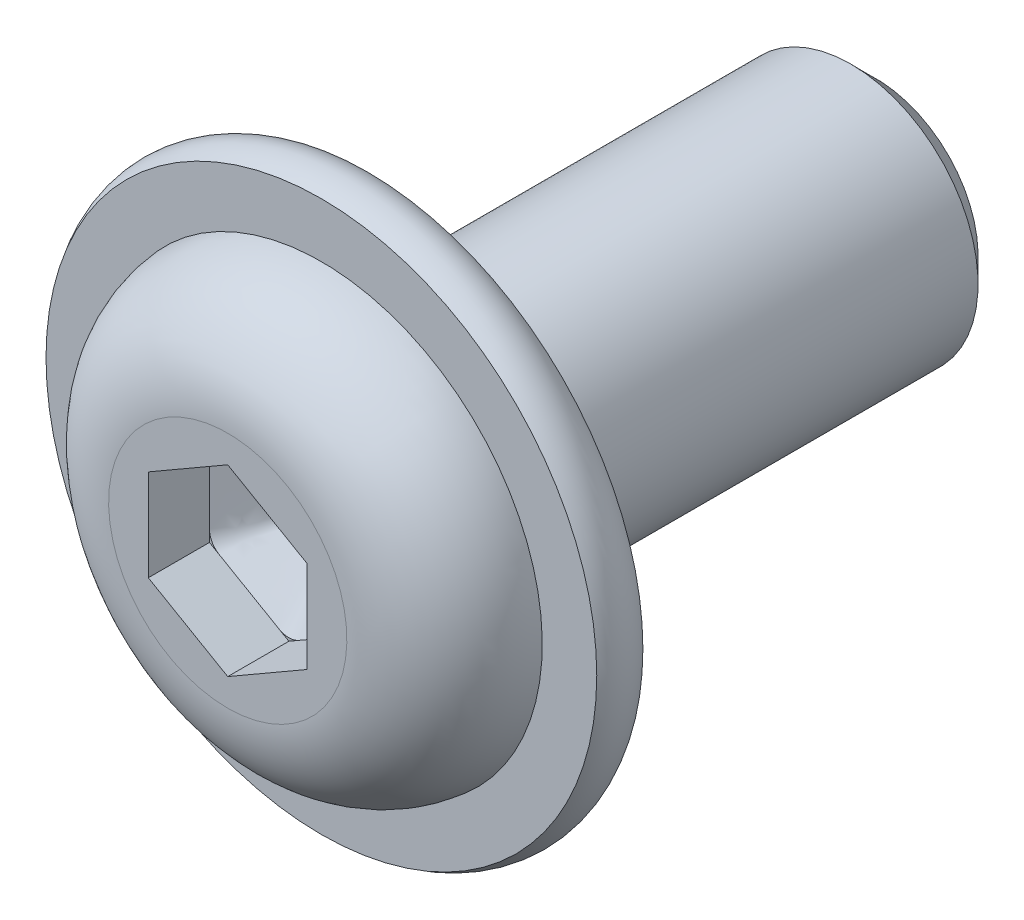
ISO-10303-21;
HEADER;
FILE_DESCRIPTION(('STEP AP214'),'2;1');
FILE_NAME('part.step','',(''),(''),'','','');
FILE_SCHEMA(('AUTOMOTIVE_DESIGN { 1 0 10303 214 1 1 1 1 }'));
ENDSEC;
DATA;
#1=APPLICATION_CONTEXT('core data for automotive mechanical design processes');
#2=APPLICATION_PROTOCOL_DEFINITION('international standard','automotive_design',2000,#1);
#3=PRODUCT_CONTEXT('',#1,'mechanical');
#4=PRODUCT('Part','Part','',(#3));
#5=PRODUCT_RELATED_PRODUCT_CATEGORY('part','',(#4));
#6=PRODUCT_DEFINITION_FORMATION('','',#4);
#7=PRODUCT_DEFINITION_CONTEXT('part definition',#1,'design');
#8=PRODUCT_DEFINITION('design','',#6,#7);
#9=PRODUCT_DEFINITION_SHAPE('','',#8);
#10=(LENGTH_UNIT() NAMED_UNIT(*) SI_UNIT(.MILLI.,.METRE.));
#11=(NAMED_UNIT(*) PLANE_ANGLE_UNIT() SI_UNIT($,.RADIAN.));
#12=(NAMED_UNIT(*) SI_UNIT($,.STERADIAN.) SOLID_ANGLE_UNIT());
#13=UNCERTAINTY_MEASURE_WITH_UNIT(LENGTH_MEASURE(1.E-05),#10,'distance_accuracy_value','');
#14=(GEOMETRIC_REPRESENTATION_CONTEXT(3) GLOBAL_UNCERTAINTY_ASSIGNED_CONTEXT((#13)) GLOBAL_UNIT_ASSIGNED_CONTEXT((#10,
#11,#12)) REPRESENTATION_CONTEXT('',''));
#15=CARTESIAN_POINT('',(0.,0.,0.));
#16=DIRECTION('',(0.,0.,1.));
#17=DIRECTION('',(1.,0.,0.));
#18=AXIS2_PLACEMENT_3D('',#15,#16,#17);
#19=CARTESIAN_POINT('',(0.,0.,8.275));
#20=DIRECTION('',(0.,0.,1.));
#21=DIRECTION('',(1.,0.,0.));
#22=AXIS2_PLACEMENT_3D('',#19,#20,#21);
#23=PLANE('',#22);
#24=CARTESIAN_POINT('',(-1.875,1.08253175473054,8.275));
#25=DIRECTION('',(0.,0.,1.));
#26=DIRECTION('',(1.,0.,0.));
#27=AXIS2_PLACEMENT_3D('',#24,#25,#26);
#28=CIRCLE('',#27,0.625);
#29=CARTESIAN_POINT('',(-2.1875,1.62379763209582,8.275));
#30=VERTEX_POINT('',#29);
#31=CARTESIAN_POINT('',(-2.5,1.08253175475083,8.275));
#32=VERTEX_POINT('',#31);
#33=EDGE_CURVE('E515',#30,#32,#28,.T.);
#34=ORIENTED_EDGE('',*,*,#33,.F.);
#35=DIRECTION('',(-0.866025403784439,-0.5,0.));
#36=VECTOR('',#35,1.);
#37=CARTESIAN_POINT('',(0.,2.88675134594813,8.275));
#38=LINE('',#37,#36);
#39=CARTESIAN_POINT('',(-2.5,1.44337567297406,8.275));
#40=VERTEX_POINT('',#39);
#41=EDGE_CURVE('E368',#30,#40,#38,.T.);
#42=ORIENTED_EDGE('',*,*,#41,.T.);
#43=DIRECTION('',(0.,-1.,0.));
#44=VECTOR('',#43,1.);
#45=CARTESIAN_POINT('',(-2.5,1.44337567297406,8.275));
#46=LINE('',#45,#44);
#47=EDGE_CURVE('E377',#40,#32,#46,.T.);
#48=ORIENTED_EDGE('',*,*,#47,.T.);
#49=EDGE_LOOP('',(#34,#42,#48));
#50=FACE_BOUND('',#49,.T.);
#51=ADVANCED_FACE('F258',(#50),#23,.T.);
#52=CARTESIAN_POINT('',(-1.875,-1.08253175473055,8.275));
#53=DIRECTION('',(0.,0.,1.));
#54=DIRECTION('',(-1.,0.,0.));
#55=AXIS2_PLACEMENT_3D('',#52,#53,#54);
#56=CIRCLE('',#55,0.625);
#57=CARTESIAN_POINT('',(-2.5,-1.08253175480025,8.275));
#58=VERTEX_POINT('',#57);
#59=CARTESIAN_POINT('',(-2.18749999999958,-1.62379763209607,8.275));
#60=VERTEX_POINT('',#59);
#61=EDGE_CURVE('E506',#58,#60,#56,.T.);
#62=ORIENTED_EDGE('',*,*,#61,.F.);
#63=CARTESIAN_POINT('',(-2.5,-1.44337567297407,8.275));
#64=VERTEX_POINT('',#63);
#65=EDGE_CURVE('E375',#58,#64,#46,.T.);
#66=ORIENTED_EDGE('',*,*,#65,.T.);
#67=DIRECTION('',(0.866025403784439,-0.5,0.));
#68=VECTOR('',#67,1.);
#69=CARTESIAN_POINT('',(-2.5,-1.44337567297407,8.275));
#70=LINE('',#69,#68);
#71=EDGE_CURVE('E400',#64,#60,#70,.T.);
#72=ORIENTED_EDGE('',*,*,#71,.T.);
#73=EDGE_LOOP('',(#62,#66,#72));
#74=FACE_BOUND('',#73,.T.);
#75=ADVANCED_FACE('F692',(#74),#23,.T.);
#76=CARTESIAN_POINT('',(0.,-2.1650635094611,8.275));
#77=DIRECTION('',(0.,0.,1.));
#78=DIRECTION('',(1.,0.,0.));
#79=AXIS2_PLACEMENT_3D('',#76,#77,#78);
#80=CIRCLE('',#79,0.625);
#81=CARTESIAN_POINT('',(-0.312500000027858,-2.70632938681029,8.275));
#82=VERTEX_POINT('',#81);
#83=CARTESIAN_POINT('',(0.312500000051481,-2.70632938679665,8.275));
#84=VERTEX_POINT('',#83);
#85=EDGE_CURVE('E580',#82,#84,#80,.T.);
#86=ORIENTED_EDGE('',*,*,#85,.F.);
#87=CARTESIAN_POINT('',(0.,-2.88675134594814,8.275));
#88=VERTEX_POINT('',#87);
#89=EDGE_CURVE('E397',#82,#88,#70,.T.);
#90=ORIENTED_EDGE('',*,*,#89,.T.);
#91=DIRECTION('',(0.866025403784439,0.5,0.));
#92=VECTOR('',#91,1.);
#93=CARTESIAN_POINT('',(0.,-2.88675134594814,8.275));
#94=LINE('',#93,#92);
#95=EDGE_CURVE('E410',#88,#84,#94,.T.);
#96=ORIENTED_EDGE('',*,*,#95,.T.);
#97=EDGE_LOOP('',(#86,#90,#96));
#98=FACE_BOUND('',#97,.T.);
#99=ADVANCED_FACE('F696',(#98),#23,.T.);
#100=CARTESIAN_POINT('',(1.875,-1.08253175473055,8.275));
#101=DIRECTION('',(0.,0.,1.));
#102=DIRECTION('',(1.,0.,0.));
#103=AXIS2_PLACEMENT_3D('',#100,#101,#102);
#104=CIRCLE('',#103,0.625);
#105=CARTESIAN_POINT('',(2.18750000000772,-1.62379763209137,8.275));
#106=VERTEX_POINT('',#105);
#107=CARTESIAN_POINT('',(2.5,-1.08253175475084,8.275));
#108=VERTEX_POINT('',#107);
#109=EDGE_CURVE('E545',#106,#108,#104,.T.);
#110=ORIENTED_EDGE('',*,*,#109,.F.);
#111=CARTESIAN_POINT('',(2.5,-1.44337567297407,8.275));
#112=VERTEX_POINT('',#111);
#113=EDGE_CURVE('E408',#106,#112,#94,.T.);
#114=ORIENTED_EDGE('',*,*,#113,.T.);
#115=DIRECTION('',(0.,1.,0.));
#116=VECTOR('',#115,1.);
#117=CARTESIAN_POINT('',(2.5,-1.44337567297407,8.275));
#118=LINE('',#117,#116);
#119=EDGE_CURVE('E424',#112,#108,#118,.T.);
#120=ORIENTED_EDGE('',*,*,#119,.T.);
#121=EDGE_LOOP('',(#110,#114,#120));
#122=FACE_BOUND('',#121,.T.);
#123=ADVANCED_FACE('F700',(#122),#23,.T.);
#124=CARTESIAN_POINT('',(1.875,1.08253175473054,8.275));
#125=DIRECTION('',(0.,0.,1.));
#126=DIRECTION('',(1.,0.,0.));
#127=AXIS2_PLACEMENT_3D('',#124,#125,#126);
#128=CIRCLE('',#127,0.625);
#129=CARTESIAN_POINT('',(2.5,1.08253175480024,8.275));
#130=VERTEX_POINT('',#129);
#131=CARTESIAN_POINT('',(2.18749999999958,1.62379763209606,8.275));
#132=VERTEX_POINT('',#131);
#133=EDGE_CURVE('E438',#130,#132,#128,.T.);
#134=ORIENTED_EDGE('',*,*,#133,.F.);
#135=CARTESIAN_POINT('',(2.5,1.44337567297406,8.275));
#136=VERTEX_POINT('',#135);
#137=EDGE_CURVE('E412',#130,#136,#118,.T.);
#138=ORIENTED_EDGE('',*,*,#137,.T.);
#139=DIRECTION('',(-0.866025403784439,0.5,0.));
#140=VECTOR('',#139,1.);
#141=CARTESIAN_POINT('',(2.5,1.44337567297406,8.275));
#142=LINE('',#141,#140);
#143=EDGE_CURVE('E429',#136,#132,#142,.T.);
#144=ORIENTED_EDGE('',*,*,#143,.T.);
#145=EDGE_LOOP('',(#134,#138,#144));
#146=FACE_BOUND('',#145,.T.);
#147=ADVANCED_FACE('F436',(#146),#23,.T.);
#148=CARTESIAN_POINT('',(0.,0.,10.2));
#149=DIRECTION('',(0.,0.,-1.));
#150=DIRECTION('',(0.,1.,0.));
#151=AXIS2_PLACEMENT_3D('',#148,#149,#150);
#152=PLANE('',#151);
#153=DIRECTION('',(0.,-1.,0.));
#154=VECTOR('',#153,1.);
#155=CARTESIAN_POINT('',(-2.5,1.44337567297406,10.2));
#156=LINE('',#155,#154);
#157=CARTESIAN_POINT('',(-2.5,1.44337567297406,10.2));
#158=VERTEX_POINT('',#157);
#159=CARTESIAN_POINT('',(-2.5,-1.44337567297407,10.2));
#160=VERTEX_POINT('',#159);
#161=EDGE_CURVE('E618',#158,#160,#156,.T.);
#162=ORIENTED_EDGE('',*,*,#161,.F.);
#163=DIRECTION('',(-0.866025403784439,-0.5,0.));
#164=VECTOR('',#163,1.);
#165=CARTESIAN_POINT('',(0.,2.88675134594813,10.2));
#166=LINE('',#165,#164);
#167=CARTESIAN_POINT('',(0.,2.88675134594813,10.2));
#168=VERTEX_POINT('',#167);
#169=EDGE_CURVE('E284',#168,#158,#166,.T.);
#170=ORIENTED_EDGE('',*,*,#169,.F.);
#171=DIRECTION('',(-0.866025403784439,0.5,0.));
#172=VECTOR('',#171,1.);
#173=CARTESIAN_POINT('',(2.5,1.44337567297406,10.2));
#174=LINE('',#173,#172);
#175=CARTESIAN_POINT('',(2.5,1.44337567297406,10.2));
#176=VERTEX_POINT('',#175);
#177=EDGE_CURVE('E379',#176,#168,#174,.T.);
#178=ORIENTED_EDGE('',*,*,#177,.F.);
#179=DIRECTION('',(0.,1.,0.));
#180=VECTOR('',#179,1.);
#181=CARTESIAN_POINT('',(2.5,-1.44337567297407,10.2));
#182=LINE('',#181,#180);
#183=CARTESIAN_POINT('',(2.5,-1.44337567297407,10.2));
#184=VERTEX_POINT('',#183);
#185=EDGE_CURVE('E446',#184,#176,#182,.T.);
#186=ORIENTED_EDGE('',*,*,#185,.F.);
#187=DIRECTION('',(0.866025403784439,0.5,0.));
#188=VECTOR('',#187,1.);
#189=CARTESIAN_POINT('',(0.,-2.88675134594814,10.2));
#190=LINE('',#189,#188);
#191=CARTESIAN_POINT('',(0.,-2.88675134594814,10.2));
#192=VERTEX_POINT('',#191);
#193=EDGE_CURVE('E625',#192,#184,#190,.T.);
#194=ORIENTED_EDGE('',*,*,#193,.F.);
#195=DIRECTION('',(0.866025403784439,-0.5,0.));
#196=VECTOR('',#195,1.);
#197=CARTESIAN_POINT('',(-2.5,-1.44337567297407,10.2));
#198=LINE('',#197,#196);
#199=EDGE_CURVE('E620',#160,#192,#198,.T.);
#200=ORIENTED_EDGE('',*,*,#199,.F.);
#201=EDGE_LOOP('',(#162,#170,#178,#186,#194,#200));
#202=FACE_BOUND('',#201,.T.);
#203=CARTESIAN_POINT('',(0.,0.,10.2));
#204=DIRECTION('',(0.,0.,1.));
#205=DIRECTION('',(0.,-1.,0.));
#206=AXIS2_PLACEMENT_3D('',#203,#204,#205);
#207=CIRCLE('',#206,3.75);
#208=CARTESIAN_POINT('',(0.,-3.75,10.2));
#209=VERTEX_POINT('',#208);
#210=EDGE_CURVE('E12',#209,#209,#207,.T.);
#211=ORIENTED_EDGE('',*,*,#210,.T.);
#212=EDGE_LOOP('',(#211));
#213=FACE_BOUND('',#212,.T.);
#214=ADVANCED_FACE('F260',(#202,#213),#152,.F.);
#215=CARTESIAN_POINT('',(0.,0.,6.98631899891452));
#216=DIRECTION('',(0.,0.,1.));
#217=DIRECTION('',(0.,-1.,0.));
#218=AXIS2_PLACEMENT_3D('',#215,#216,#217);
#219=TOROIDAL_SURFACE('',#218,3.75,3.21368100108548);
#220=ORIENTED_EDGE('',*,*,#210,.F.);
#221=EDGE_LOOP('',(#220));
#222=FACE_BOUND('',#221,.T.);
#223=CARTESIAN_POINT('',(0.,0.,7.252));
#224=DIRECTION('',(0.,0.,1.));
#225=DIRECTION('',(0.,-1.,0.));
#226=AXIS2_PLACEMENT_3D('',#223,#224,#225);
#227=CIRCLE('',#226,6.95268);
#228=CARTESIAN_POINT('',(0.,-6.95268000000001,7.252));
#229=VERTEX_POINT('',#228);
#230=EDGE_CURVE('E268',#229,#229,#227,.T.);
#231=ORIENTED_EDGE('',*,*,#230,.T.);
#232=EDGE_LOOP('',(#231));
#233=FACE_BOUND('',#232,.T.);
#234=ADVANCED_FACE('F652',(#222,#233),#219,.T.);
#235=CARTESIAN_POINT('',(0.,8.6686,7.252));
#236=DIRECTION('',(0.,0.,-1.));
#237=DIRECTION('',(0.,1.,0.));
#238=AXIS2_PLACEMENT_3D('',#235,#236,#237);
#239=PLANE('',#238);
#240=ORIENTED_EDGE('',*,*,#230,.F.);
#241=EDGE_LOOP('',(#240));
#242=FACE_BOUND('',#241,.T.);
#243=CARTESIAN_POINT('',(0.,0.,7.252));
#244=DIRECTION('',(0.,0.,1.));
#245=DIRECTION('',(0.,-1.,0.));
#246=AXIS2_PLACEMENT_3D('',#243,#244,#245);
#247=CIRCLE('',#246,8.6686);
#248=CARTESIAN_POINT('',(0.,-8.6686,7.252));
#249=VERTEX_POINT('',#248);
#250=EDGE_CURVE('E647',#249,#249,#247,.T.);
#251=ORIENTED_EDGE('',*,*,#250,.T.);
#252=EDGE_LOOP('',(#251));
#253=FACE_BOUND('',#252,.T.);
#254=ADVANCED_FACE('F654',(#242,#253),#239,.F.);
#255=CARTESIAN_POINT('',(0.,0.,6.526));
#256=DIRECTION('',(0.,0.,1.));
#257=DIRECTION('',(0.,-1.,0.));
#258=AXIS2_PLACEMENT_3D('',#255,#256,#257);
#259=TOROIDAL_SURFACE('',#258,7.64541495246327,1.25458504753673);
#260=ORIENTED_EDGE('',*,*,#250,.F.);
#261=EDGE_LOOP('',(#260));
#262=FACE_BOUND('',#261,.T.);
#263=CARTESIAN_POINT('',(0.,0.,5.8));
#264=DIRECTION('',(0.,0.,1.));
#265=DIRECTION('',(0.,-1.,0.));
#266=AXIS2_PLACEMENT_3D('',#263,#264,#265);
#267=CIRCLE('',#266,8.6686);
#268=CARTESIAN_POINT('',(0.,-8.6686,5.8));
#269=VERTEX_POINT('',#268);
#270=EDGE_CURVE('E644',#269,#269,#267,.T.);
#271=ORIENTED_EDGE('',*,*,#270,.T.);
#272=EDGE_LOOP('',(#271));
#273=FACE_BOUND('',#272,.T.);
#274=ADVANCED_FACE('F657',(#262,#273),#259,.T.);
#275=CARTESIAN_POINT('',(0.,4.,5.8));
#276=DIRECTION('',(0.,0.,1.));
#277=DIRECTION('',(0.,-1.,0.));
#278=AXIS2_PLACEMENT_3D('',#275,#276,#277);
#279=PLANE('',#278);
#280=ORIENTED_EDGE('',*,*,#270,.F.);
#281=EDGE_LOOP('',(#280));
#282=FACE_BOUND('',#281,.T.);
#283=CARTESIAN_POINT('',(0.,0.,5.8));
#284=DIRECTION('',(0.,0.,1.));
#285=DIRECTION('',(0.,-1.,0.));
#286=AXIS2_PLACEMENT_3D('',#283,#284,#285);
#287=CIRCLE('',#286,4.);
#288=CARTESIAN_POINT('',(0.,-4.00000000000001,5.8));
#289=VERTEX_POINT('',#288);
#290=EDGE_CURVE('E641',#289,#289,#287,.T.);
#291=ORIENTED_EDGE('',*,*,#290,.T.);
#292=EDGE_LOOP('',(#291));
#293=FACE_BOUND('',#292,.T.);
#294=ADVANCED_FACE('F663',(#282,#293),#279,.F.);
#295=CARTESIAN_POINT('',(0.,0.,10.2));
#296=DIRECTION('',(0.,0.,1.));
#297=DIRECTION('',(0.,-1.,0.));
#298=AXIS2_PLACEMENT_3D('',#295,#296,#297);
#299=CYLINDRICAL_SURFACE('',#298,4.);
#300=ORIENTED_EDGE('',*,*,#290,.F.);
#301=EDGE_LOOP('',(#300));
#302=FACE_BOUND('',#301,.T.);
#303=CARTESIAN_POINT('',(0.,0.,-9.41875));
#304=DIRECTION('',(0.,0.,1.));
#305=DIRECTION('',(0.,-1.,0.));
#306=AXIS2_PLACEMENT_3D('',#303,#304,#305);
#307=CIRCLE('',#306,4.);
#308=CARTESIAN_POINT('',(0.,-4.,-9.41875));
#309=VERTEX_POINT('',#308);
#310=EDGE_CURVE('E638',#309,#309,#307,.T.);
#311=ORIENTED_EDGE('',*,*,#310,.T.);
#312=EDGE_LOOP('',(#311));
#313=FACE_BOUND('',#312,.T.);
#314=ADVANCED_FACE('F669',(#302,#313),#299,.T.);
#315=CARTESIAN_POINT('',(0.,0.,-10.2));
#316=DIRECTION('',(0.,0.,1.));
#317=DIRECTION('',(0.,-1.,0.));
#318=AXIS2_PLACEMENT_3D('',#315,#316,#317);
#319=CONICAL_SURFACE('',#318,3.21875000000001,0.785398163397441);
#320=ORIENTED_EDGE('',*,*,#310,.F.);
#321=EDGE_LOOP('',(#320));
#322=FACE_BOUND('',#321,.T.);
#323=CARTESIAN_POINT('',(0.,0.,-10.2));
#324=DIRECTION('',(0.,0.,1.));
#325=DIRECTION('',(0.,-1.,0.));
#326=AXIS2_PLACEMENT_3D('',#323,#324,#325);
#327=CIRCLE('',#326,3.21875000000001);
#328=CARTESIAN_POINT('',(0.,-3.21875000000001,-10.2));
#329=VERTEX_POINT('',#328);
#330=EDGE_CURVE('E630',#329,#329,#327,.T.);
#331=ORIENTED_EDGE('',*,*,#330,.T.);
#332=EDGE_LOOP('',(#331));
#333=FACE_BOUND('',#332,.T.);
#334=ADVANCED_FACE('F675',(#322,#333),#319,.T.);
#335=CARTESIAN_POINT('',(0.,3.21875000000001,-10.2));
#336=DIRECTION('',(0.,0.,1.));
#337=DIRECTION('',(0.,-1.,0.));
#338=AXIS2_PLACEMENT_3D('',#335,#336,#337);
#339=PLANE('',#338);
#340=ORIENTED_EDGE('',*,*,#330,.F.);
#341=EDGE_LOOP('',(#340));
#342=FACE_BOUND('',#341,.T.);
#343=ADVANCED_FACE('F681',(#342),#339,.F.);
#344=CARTESIAN_POINT('',(0.,2.88675134594813,8.275));
#345=DIRECTION('',(-0.5,0.866025403784439,0.));
#346=DIRECTION('',(-0.866025403784439,-0.5,0.));
#347=AXIS2_PLACEMENT_3D('',#344,#345,#346);
#348=PLANE('',#347);
#349=ORIENTED_EDGE('',*,*,#169,.T.);
#350=DIRECTION('',(0.,0.,1.));
#351=VECTOR('',#350,1.);
#352=CARTESIAN_POINT('',(-2.5,1.44337567297406,8.275));
#353=LINE('',#352,#351);
#354=EDGE_CURVE('E455',#40,#158,#353,.T.);
#355=ORIENTED_EDGE('',*,*,#354,.F.);
#356=ORIENTED_EDGE('',*,*,#41,.F.);
#357=DIRECTION('',(-0.866025403784439,-0.5,0.));
#358=VECTOR('',#357,1.);
#359=CARTESIAN_POINT('',(-0.312499999999999,2.70632938682636,8.275));
#360=LINE('',#359,#358);
#361=CARTESIAN_POINT('',(-0.312499999999999,2.70632938682636,8.275));
#362=VERTEX_POINT('',#361);
#363=EDGE_CURVE('E353',#362,#30,#360,.T.);
#364=ORIENTED_EDGE('',*,*,#363,.F.);
#365=CARTESIAN_POINT('',(0.,2.88675134594813,8.275));
#366=VERTEX_POINT('',#365);
#367=EDGE_CURVE('E367',#366,#362,#38,.T.);
#368=ORIENTED_EDGE('',*,*,#367,.F.);
#369=DIRECTION('',(0.,0.,1.));
#370=VECTOR('',#369,1.);
#371=CARTESIAN_POINT('',(0.,2.88675134594813,8.275));
#372=LINE('',#371,#370);
#373=EDGE_CURVE('E450',#366,#168,#372,.T.);
#374=ORIENTED_EDGE('',*,*,#373,.T.);
#375=EDGE_LOOP('',(#349,#355,#356,#364,#368,#374));
#376=FACE_BOUND('',#375,.T.);
#377=ADVANCED_FACE('F366',(#376),#348,.F.);
#378=CARTESIAN_POINT('',(2.5,1.44337567297406,8.275));
#379=DIRECTION('',(0.5,0.866025403784439,0.));
#380=DIRECTION('',(-0.866025403784439,0.5,0.));
#381=AXIS2_PLACEMENT_3D('',#378,#379,#380);
#382=PLANE('',#381);
#383=ORIENTED_EDGE('',*,*,#177,.T.);
#384=ORIENTED_EDGE('',*,*,#373,.F.);
#385=CARTESIAN_POINT('',(0.312500000000003,2.70632938682637,8.275));
#386=VERTEX_POINT('',#385);
#387=EDGE_CURVE('E373',#386,#366,#142,.T.);
#388=ORIENTED_EDGE('',*,*,#387,.F.);
#389=DIRECTION('',(-0.866025403784438,0.5,0.));
#390=VECTOR('',#389,1.);
#391=CARTESIAN_POINT('',(2.1875,1.62379763209582,8.275));
#392=LINE('',#391,#390);
#393=EDGE_CURVE('E262',#132,#386,#392,.T.);
#394=ORIENTED_EDGE('',*,*,#393,.F.);
#395=ORIENTED_EDGE('',*,*,#143,.F.);
#396=DIRECTION('',(0.,0.,1.));
#397=VECTOR('',#396,1.);
#398=CARTESIAN_POINT('',(2.5,1.44337567297406,8.275));
#399=LINE('',#398,#397);
#400=EDGE_CURVE('E443',#136,#176,#399,.T.);
#401=ORIENTED_EDGE('',*,*,#400,.T.);
#402=EDGE_LOOP('',(#383,#384,#388,#394,#395,#401));
#403=FACE_BOUND('',#402,.T.);
#404=ADVANCED_FACE('F453',(#403),#382,.F.);
#405=CARTESIAN_POINT('',(2.5,-1.44337567297407,8.275));
#406=DIRECTION('',(1.,0.,0.));
#407=DIRECTION('',(0.,0.,-1.));
#408=AXIS2_PLACEMENT_3D('',#405,#406,#407);
#409=PLANE('',#408);
#410=ORIENTED_EDGE('',*,*,#185,.T.);
#411=ORIENTED_EDGE('',*,*,#400,.F.);
#412=ORIENTED_EDGE('',*,*,#137,.F.);
#413=DIRECTION('',(0.,1.,0.));
#414=VECTOR('',#413,1.);
#415=CARTESIAN_POINT('',(2.5,-1.08253175473055,8.275));
#416=LINE('',#415,#414);
#417=EDGE_CURVE('E536',#108,#130,#416,.T.);
#418=ORIENTED_EDGE('',*,*,#417,.F.);
#419=ORIENTED_EDGE('',*,*,#119,.F.);
#420=DIRECTION('',(0.,0.,1.));
#421=VECTOR('',#420,1.);
#422=CARTESIAN_POINT('',(2.5,-1.44337567297407,8.275));
#423=LINE('',#422,#421);
#424=EDGE_CURVE('E451',#112,#184,#423,.T.);
#425=ORIENTED_EDGE('',*,*,#424,.T.);
#426=EDGE_LOOP('',(#410,#411,#412,#418,#419,#425));
#427=FACE_BOUND('',#426,.T.);
#428=ADVANCED_FACE('F444',(#427),#409,.F.);
#429=CARTESIAN_POINT('',(0.,-2.88675134594814,8.275));
#430=DIRECTION('',(0.5,-0.866025403784439,0.));
#431=DIRECTION('',(0.866025403784439,0.5,0.));
#432=AXIS2_PLACEMENT_3D('',#429,#430,#431);
#433=PLANE('',#432);
#434=ORIENTED_EDGE('',*,*,#193,.T.);
#435=ORIENTED_EDGE('',*,*,#424,.F.);
#436=ORIENTED_EDGE('',*,*,#113,.F.);
#437=DIRECTION('',(0.866025403784439,0.5,0.));
#438=VECTOR('',#437,1.);
#439=CARTESIAN_POINT('',(0.3125,-2.70632938682637,8.275));
#440=LINE('',#439,#438);
#441=EDGE_CURVE('E573',#84,#106,#440,.T.);
#442=ORIENTED_EDGE('',*,*,#441,.F.);
#443=ORIENTED_EDGE('',*,*,#95,.F.);
#444=DIRECTION('',(0.,0.,1.));
#445=VECTOR('',#444,1.);
#446=CARTESIAN_POINT('',(0.,-2.88675134594814,8.275));
#447=LINE('',#446,#445);
#448=EDGE_CURVE('E633',#88,#192,#447,.T.);
#449=ORIENTED_EDGE('',*,*,#448,.T.);
#450=EDGE_LOOP('',(#434,#435,#436,#442,#443,#449));
#451=FACE_BOUND('',#450,.T.);
#452=ADVANCED_FACE('F558',(#451),#433,.F.);
#453=CARTESIAN_POINT('',(-2.5,-1.44337567297407,8.275));
#454=DIRECTION('',(-0.5,-0.866025403784439,0.));
#455=DIRECTION('',(0.866025403784439,-0.5,0.));
#456=AXIS2_PLACEMENT_3D('',#453,#454,#455);
#457=PLANE('',#456);
#458=ORIENTED_EDGE('',*,*,#199,.T.);
#459=ORIENTED_EDGE('',*,*,#448,.F.);
#460=ORIENTED_EDGE('',*,*,#89,.F.);
#461=DIRECTION('',(0.866025403784439,-0.5,0.));
#462=VECTOR('',#461,1.);
#463=CARTESIAN_POINT('',(-2.1875,-1.62379763209583,8.275));
#464=LINE('',#463,#462);
#465=EDGE_CURVE('E589',#60,#82,#464,.T.);
#466=ORIENTED_EDGE('',*,*,#465,.F.);
#467=ORIENTED_EDGE('',*,*,#71,.F.);
#468=DIRECTION('',(0.,0.,1.));
#469=VECTOR('',#468,1.);
#470=CARTESIAN_POINT('',(-2.5,-1.44337567297407,8.275));
#471=LINE('',#470,#469);
#472=EDGE_CURVE('E456',#64,#160,#471,.T.);
#473=ORIENTED_EDGE('',*,*,#472,.T.);
#474=EDGE_LOOP('',(#458,#459,#460,#466,#467,#473));
#475=FACE_BOUND('',#474,.T.);
#476=ADVANCED_FACE('F562',(#475),#457,.F.);
#477=CARTESIAN_POINT('',(-2.5,1.44337567297406,8.275));
#478=DIRECTION('',(-1.,0.,0.));
#479=DIRECTION('',(0.,-1.,0.));
#480=AXIS2_PLACEMENT_3D('',#477,#478,#479);
#481=PLANE('',#480);
#482=ORIENTED_EDGE('',*,*,#161,.T.);
#483=ORIENTED_EDGE('',*,*,#472,.F.);
#484=ORIENTED_EDGE('',*,*,#65,.F.);
#485=DIRECTION('',(0.,-1.,0.));
#486=VECTOR('',#485,1.);
#487=CARTESIAN_POINT('',(-2.5,1.08253175473054,8.275));
#488=LINE('',#487,#486);
#489=EDGE_CURVE('E518',#32,#58,#488,.T.);
#490=ORIENTED_EDGE('',*,*,#489,.F.);
#491=ORIENTED_EDGE('',*,*,#47,.F.);
#492=ORIENTED_EDGE('',*,*,#354,.T.);
#493=EDGE_LOOP('',(#482,#483,#484,#490,#491,#492));
#494=FACE_BOUND('',#493,.T.);
#495=ADVANCED_FACE('F473',(#494),#481,.F.);
#496=CARTESIAN_POINT('',(0.,2.16506350946109,8.275));
#497=DIRECTION('',(0.,0.,1.));
#498=DIRECTION('',(1.,0.,0.));
#499=AXIS2_PLACEMENT_3D('',#496,#497,#498);
#500=CIRCLE('',#499,0.625);
#501=EDGE_CURVE('E348',#386,#362,#500,.T.);
#502=ORIENTED_EDGE('',*,*,#501,.F.);
#503=ORIENTED_EDGE('',*,*,#387,.T.);
#504=ORIENTED_EDGE('',*,*,#367,.T.);
#505=EDGE_LOOP('',(#502,#503,#504));
#506=FACE_BOUND('',#505,.T.);
#507=ADVANCED_FACE('F372',(#506),#23,.T.);
#508=CARTESIAN_POINT('',(0.,0.,6.526));
#509=DIRECTION('',(0.,0.,1.));
#510=DIRECTION('',(1.,0.,0.));
#511=AXIS2_PLACEMENT_3D('',#508,#509,#510);
#512=PLANE('',#511);
#513=CARTESIAN_POINT('',(0.,0.,6.526));
#514=DIRECTION('',(0.,0.,1.));
#515=DIRECTION('',(1.,0.,0.));
#516=AXIS2_PLACEMENT_3D('',#513,#514,#515);
#517=CIRCLE('',#516,0.175);
#518=CARTESIAN_POINT('',(0.175,0.,6.526));
#519=VERTEX_POINT('',#518);
#520=EDGE_CURVE('E369',#519,#519,#517,.T.);
#521=ORIENTED_EDGE('',*,*,#520,.T.);
#522=EDGE_LOOP('',(#521));
#523=FACE_BOUND('',#522,.T.);
#524=ADVANCED_FACE('F472',(#523),#512,.T.);
#525=CARTESIAN_POINT('',(0.312500000273664,2.70632938666836,8.275));
#526=CARTESIAN_POINT('',(0.0200738766966503,0.17384487186675,6.526));
#527=CARTESIAN_POINT('',(0.470028749259429,2.61538012103633,8.275));
#528=CARTESIAN_POINT('',(0.0318184717452628,0.172488722844182,6.526));
#529=CARTESIAN_POINT('',(0.783145089334924,2.43460231780606,8.27499999999999));
#530=CARTESIAN_POINT('',(0.0551747739118185,0.167367870211435,6.526));
#531=CARTESIAN_POINT('',(1.25,2.16506350946109,8.27500000000001));
#532=CARTESIAN_POINT('',(0.0881174254107772,0.152623857843624,6.526));
#533=CARTESIAN_POINT('',(1.71685491066507,1.89552470111611,8.27499999999999));
#534=CARTESIAN_POINT('',(0.117357440424493,0.131466690961414,6.526));
#535=CARTESIAN_POINT('',(2.02997125074057,1.71474689788585,8.275));
#536=CARTESIAN_POINT('',(0.133470379976766,0.113799966263084,6.526));
#537=CARTESIAN_POINT('',(2.23345560883067,1.59726514896665,8.275));
#538=CARTESIAN_POINT('',(0.142572876123845,0.101537532861186,6.526));
#539=CARTESIAN_POINT('',(2.3204287551678,1.53128704145715,8.275));
#540=CARTESIAN_POINT('',(0.146432390834959,0.0959986177038103,6.526));
#541=CARTESIAN_POINT('',(2.42272823404165,1.39873990564613,8.275));
#542=CARTESIAN_POINT('',(0.151635181272801,0.0875466127264664,6.526));
#543=CARTESIAN_POINT('',(2.48634129586638,1.243918233549,8.275));
#544=CARTESIAN_POINT('',(0.156353437077172,0.078814861548056,6.526));
#545=CARTESIAN_POINT('',(2.5,1.13559672098887,8.275));
#546=CARTESIAN_POINT('',(0.15922052095731,0.0727029661832637,6.526));
#547=CARTESIAN_POINT('',(2.5,0.90063322315047,8.275));
#548=CARTESIAN_POINT('',(0.165288851722029,0.0586887565810946,6.526));
#549=CARTESIAN_POINT('',(2.5,0.539077616689953,8.27500000000002));
#550=CARTESIAN_POINT('',(0.172532214336312,0.0359011792500186,6.526));
#551=CARTESIAN_POINT('',(2.5,0.,8.27499999999998));
#552=CARTESIAN_POINT('',(0.176234850821554,0.,6.52599999999999));
#553=CARTESIAN_POINT('',(2.5,-0.539077616689964,8.27500000000001));
#554=CARTESIAN_POINT('',(0.172532214336312,-0.0359011792500245,6.52600000000001));
#555=CARTESIAN_POINT('',(2.5,-0.900633223150479,8.275));
#556=CARTESIAN_POINT('',(0.165288851722029,-0.0586887565811006,6.526));
#557=CARTESIAN_POINT('',(2.5,-1.13559672098888,8.275));
#558=CARTESIAN_POINT('',(0.15922052095731,-0.0727029661832697,6.526));
#559=CARTESIAN_POINT('',(2.48634785597172,-1.24390672891864,8.275));
#560=CARTESIAN_POINT('',(0.156353437077172,-0.078814861548062,6.526));
#561=CARTESIAN_POINT('',(2.42270840859742,-1.39877424432282,8.275));
#562=CARTESIAN_POINT('',(0.151635181272801,-0.0875466127264725,6.52600000000001));
#563=CARTESIAN_POINT('',(2.3204354384173,-1.53127560792411,8.275));
#564=CARTESIAN_POINT('',(0.146432390834958,-0.0959986177038164,6.526));
#565=CARTESIAN_POINT('',(2.23345560883067,-1.59726514896666,8.275));
#566=CARTESIAN_POINT('',(0.142572876123845,-0.101537532861192,6.526));
#567=CARTESIAN_POINT('',(2.02997125074057,-1.71474689788586,8.275));
#568=CARTESIAN_POINT('',(0.133470379976766,-0.11379996626309,6.526));
#569=CARTESIAN_POINT('',(1.71685491066507,-1.89552470111612,8.275));
#570=CARTESIAN_POINT('',(0.117357440424493,-0.13146669096142,6.526));
#571=CARTESIAN_POINT('',(1.25,-2.1650635094611,8.275));
#572=CARTESIAN_POINT('',(0.0881174254107772,-0.15262385784363,6.526));
#573=CARTESIAN_POINT('',(0.783145089334924,-2.43460231780608,8.27499999999999));
#574=CARTESIAN_POINT('',(0.0551747739118184,-0.167367870211441,6.526));
#575=CARTESIAN_POINT('',(0.470028749259428,-2.61538012103634,8.275));
#576=CARTESIAN_POINT('',(0.0318184717452627,-0.172488722844188,6.526));
#577=CARTESIAN_POINT('',(0.266544391169327,-2.73286186995553,8.275));
#578=CARTESIAN_POINT('',(0.0166476448334649,-0.174240499044459,6.526));
#579=CARTESIAN_POINT('',(0.165919100803914,-2.77519377037579,8.275));
#580=CARTESIAN_POINT('',(0.00992104624221366,-0.174813479251875,6.526));
#581=CARTESIAN_POINT('',(-1.98254442252207E-05,-2.79751414996896,8.275));
#582=CARTESIAN_POINT('',(0.,-0.175093225452942,6.526));
#583=CARTESIAN_POINT('',(-0.165905857449088,-2.77519384147311,8.275));
#584=CARTESIAN_POINT('',(-0.00992104624221372,-0.174813479251875,6.526));
#585=CARTESIAN_POINT('',(-0.266544391169327,-2.73286186995553,8.275));
#586=CARTESIAN_POINT('',(-0.016647644833465,-0.174240499044459,6.526));
#587=CARTESIAN_POINT('',(-0.470028749259428,-2.61538012103634,8.275));
#588=CARTESIAN_POINT('',(-0.0318184717452627,-0.172488722844188,6.526));
#589=CARTESIAN_POINT('',(-0.783145089334926,-2.43460231780608,8.275));
#590=CARTESIAN_POINT('',(-0.0551747739118184,-0.167367870211441,6.52600000000001));
#591=CARTESIAN_POINT('',(-1.25,-2.1650635094611,8.275));
#592=CARTESIAN_POINT('',(-0.0881174254107773,-0.15262385784363,6.52599999999999));
#593=CARTESIAN_POINT('',(-1.71685491066507,-1.89552470111612,8.27500000000001));
#594=CARTESIAN_POINT('',(-0.117357440424493,-0.13146669096142,6.52600000000001));
#595=CARTESIAN_POINT('',(-2.02997125074057,-1.71474689788586,8.275));
#596=CARTESIAN_POINT('',(-0.133470379976766,-0.11379996626309,6.526));
#597=CARTESIAN_POINT('',(-2.23345560883067,-1.59726514896666,8.275));
#598=CARTESIAN_POINT('',(-0.142572876123845,-0.101537532861192,6.526));
#599=CARTESIAN_POINT('',(-2.3204287551678,-1.53128704145716,8.275));
#600=CARTESIAN_POINT('',(-0.146432390834959,-0.0959986177038162,6.526));
#601=CARTESIAN_POINT('',(-2.42272823404165,-1.39873990564614,8.275));
#602=CARTESIAN_POINT('',(-0.151635181272801,-0.0875466127264724,6.52600000000001));
#603=CARTESIAN_POINT('',(-2.48634129586638,-1.24391823354901,8.275));
#604=CARTESIAN_POINT('',(-0.156353437077172,-0.0788148615480618,6.526));
#605=CARTESIAN_POINT('',(-2.5,-1.13559672098888,8.275));
#606=CARTESIAN_POINT('',(-0.15922052095731,-0.0727029661832696,6.526));
#607=CARTESIAN_POINT('',(-2.5,-0.90063322315048,8.275));
#608=CARTESIAN_POINT('',(-0.165288851722029,-0.0586887565811005,6.526));
#609=CARTESIAN_POINT('',(-2.5,-0.539077616689962,8.275));
#610=CARTESIAN_POINT('',(-0.172532214336312,-0.0359011792500245,6.526));
#611=CARTESIAN_POINT('',(-2.5,0.,8.275));
#612=CARTESIAN_POINT('',(-0.176234850821554,0.,6.526));
#613=CARTESIAN_POINT('',(-2.5,0.539077616689955,8.275));
#614=CARTESIAN_POINT('',(-0.172532214336312,0.0359011792500186,6.526));
#615=CARTESIAN_POINT('',(-2.5,0.90063322315047,8.275));
#616=CARTESIAN_POINT('',(-0.165288851722029,0.0586887565810946,6.526));
#617=CARTESIAN_POINT('',(-2.5,1.13559672098887,8.275));
#618=CARTESIAN_POINT('',(-0.15922052095731,0.0727029661832636,6.526));
#619=CARTESIAN_POINT('',(-2.48634785597171,1.24390672891863,8.275));
#620=CARTESIAN_POINT('',(-0.156353437077172,0.0788148615480561,6.526));
#621=CARTESIAN_POINT('',(-2.42270840859742,1.39877424432281,8.275));
#622=CARTESIAN_POINT('',(-0.151635181272801,0.0875466127264661,6.526));
#623=CARTESIAN_POINT('',(-2.32043543841729,1.5312756079241,8.275));
#624=CARTESIAN_POINT('',(-0.146432390834959,0.0959986177038105,6.52600000000001));
#625=CARTESIAN_POINT('',(-2.23345560883067,1.59726514896665,8.275));
#626=CARTESIAN_POINT('',(-0.142572876123845,0.101537532861186,6.526));
#627=CARTESIAN_POINT('',(-2.02997125074057,1.71474689788585,8.275));
#628=CARTESIAN_POINT('',(-0.133470379976766,0.113799966263084,6.526));
#629=CARTESIAN_POINT('',(-1.71685491066507,1.89552470111611,8.27500000000001));
#630=CARTESIAN_POINT('',(-0.117357440424493,0.131466690961414,6.52600000000001));
#631=CARTESIAN_POINT('',(-1.25,2.16506350946109,8.275));
#632=CARTESIAN_POINT('',(-0.0881174254107771,0.152623857843624,6.52599999999999));
#633=CARTESIAN_POINT('',(-0.783145089334923,2.43460231780607,8.275));
#634=CARTESIAN_POINT('',(-0.0551747739118184,0.167367870211436,6.52600000000001));
#635=CARTESIAN_POINT('',(-0.470028749259427,2.61538012103633,8.275));
#636=CARTESIAN_POINT('',(-0.0318184717452626,0.172488722844182,6.526));
#637=CARTESIAN_POINT('',(-0.266544391169326,2.73286186995552,8.275));
#638=CARTESIAN_POINT('',(-0.0166476448334648,0.174240499044453,6.526));
#639=CARTESIAN_POINT('',(-0.165919100803913,2.77519377037579,8.275));
#640=CARTESIAN_POINT('',(-0.00992104624221347,0.174813479251869,6.52599999999999));
#641=CARTESIAN_POINT('',(1.98254442265624E-05,2.79751414996894,8.275));
#642=CARTESIAN_POINT('',(0.,0.175093225452936,6.526));
#643=CARTESIAN_POINT('',(0.165905857449089,2.7751938414731,8.275));
#644=CARTESIAN_POINT('',(0.00992104624221384,0.174813479251869,6.526));
#645=CARTESIAN_POINT('',(0.266544391169328,2.73286186995552,8.275));
#646=CARTESIAN_POINT('',(0.016647644833465,0.174240499044453,6.526));
#647=CARTESIAN_POINT('',(0.312500000273664,2.70632938666836,8.275));
#648=CARTESIAN_POINT('',(0.0200738766966503,0.17384487186675,6.526));
#649=B_SPLINE_SURFACE_WITH_KNOTS('',3,1,((#525,#526),(#527,#528),(#529,#530),(#531,#532),(#533,
#534),(#535,#536),(#537,#538),(#539,#540),(#541,#542),(#543,#544),(#545,#546),(#547,#548),(#549,
#550),(#551,#552),(#553,#554),(#555,#556),(#557,#558),(#559,#560),(#561,#562),(#563,#564),(#565,
#566),(#567,#568),(#569,#570),(#571,#572),(#573,#574),(#575,#576),(#577,#578),(#579,#580),(#581,
#582),(#583,#584),(#585,#586),(#587,#588),(#589,#590),(#591,#592),(#593,#594),(#595,#596),(#597,
#598),(#599,#600),(#601,#602),(#603,#604),(#605,#606),(#607,#608),(#609,#610),(#611,#612),(#613,
#614),(#615,#616),(#617,#618),(#619,#620),(#621,#622),(#623,#624),(#625,#626),(#627,#628),(#629,
#630),(#631,#632),(#633,#634),(#635,#636),(#637,#638),(#639,#640),(#641,#642),(#643,#644),(#645,
#646),(#647,#648)),.UNSPECIFIED.,.T.,.F.,.F.,(4,1,1,1,2,1,1,1,2,1,1,1,2,1,1,1,2,1,1,1,2,1,1,1,2,
1,1,1,2,1,1,1,2,1,1,1,2,1,1,1,2,1,1,1,2,1,1,1,4),(2,2),(0.,0.0322565229878777,
0.0645130459757554,0.0967695689636332,0.129026091951511,0.1384362356303,0.147846379309089,
0.157256522987878,0.166666666666667,0.198923189654544,0.231179712642422,0.2634362356303,
0.295692758618178,0.305102902296966,0.314513045975755,0.323923189654544,0.333333333333333,
0.365589856321211,0.397846379309089,0.430102902296966,0.462359425284844,0.471769568963633,
0.481179712642422,0.490589856321211,0.5,0.532256522987878,0.564513045975755,0.596769568963633,
0.629026091951511,0.6384362356303,0.647846379309089,0.657256522987878,0.666666666666667,
0.698923189654544,0.731179712642422,0.7634362356303,0.795692758618177,0.805102902296966,
0.814513045975755,0.823923189654544,0.833333333333333,0.865589856321211,0.897846379309089,
0.930102902296966,0.962359425284844,0.971769568963633,0.981179712642422,0.990589856321211,1.),
(0.,1.),.UNSPECIFIED.);
#650=ORIENTED_EDGE('',*,*,#501,.T.);
#651=ORIENTED_EDGE('',*,*,#363,.T.);
#652=ORIENTED_EDGE('',*,*,#33,.T.);
#653=ORIENTED_EDGE('',*,*,#489,.T.);
#654=ORIENTED_EDGE('',*,*,#61,.T.);
#655=ORIENTED_EDGE('',*,*,#465,.T.);
#656=ORIENTED_EDGE('',*,*,#85,.T.);
#657=ORIENTED_EDGE('',*,*,#441,.T.);
#658=ORIENTED_EDGE('',*,*,#109,.T.);
#659=ORIENTED_EDGE('',*,*,#417,.T.);
#660=ORIENTED_EDGE('',*,*,#133,.T.);
#661=ORIENTED_EDGE('',*,*,#393,.T.);
#662=EDGE_LOOP('',(#650,#651,#652,#653,#654,#655,#656,#657,#658,#659,#660,#661));
#663=FACE_BOUND('',#662,.T.);
#664=ORIENTED_EDGE('',*,*,#520,.F.);
#665=EDGE_LOOP('',(#664));
#666=FACE_BOUND('',#665,.T.);
#667=ADVANCED_FACE('F351',(#663,#666),#649,.F.);
#668=CLOSED_SHELL('',(#51,#75,#99,#123,#147,#214,#234,#254,#274,#294,#314,#334,#343,#377,#404,
#428,#452,#476,#495,#507,#524,#667));
#669=MANIFOLD_SOLID_BREP('B2',#668);
#670=ADVANCED_BREP_SHAPE_REPRESENTATION('',(#18,#669),#14);
#671=SHAPE_DEFINITION_REPRESENTATION(#9,#670);
ENDSEC;
END-ISO-10303-21;
